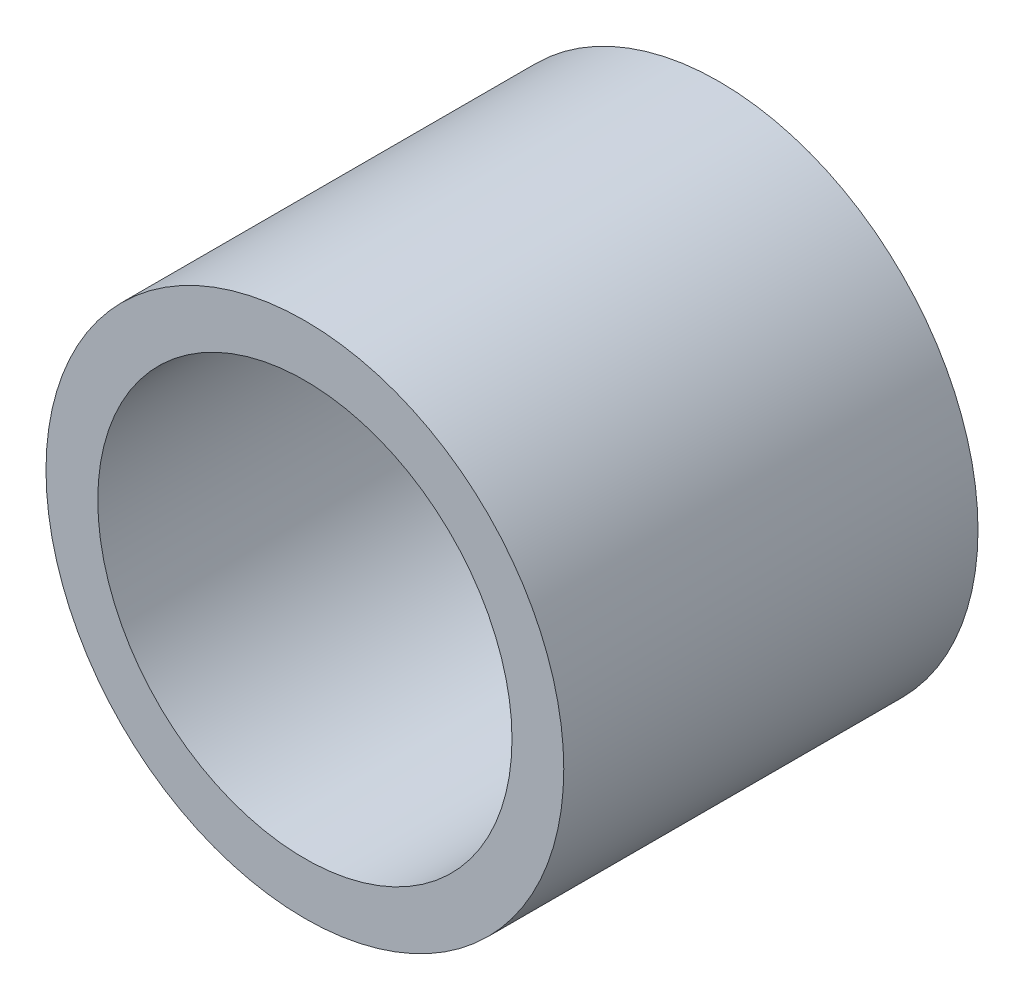
ISO-10303-21;
HEADER;
FILE_DESCRIPTION(('STEP AP214'),'2;1');
FILE_NAME('part.step','',(''),(''),'','','');
FILE_SCHEMA(('AUTOMOTIVE_DESIGN { 1 0 10303 214 1 1 1 1 }'));
ENDSEC;
DATA;
#1=APPLICATION_CONTEXT('core data for automotive mechanical design processes');
#2=APPLICATION_PROTOCOL_DEFINITION('international standard','automotive_design',2000,#1);
#3=PRODUCT_CONTEXT('',#1,'mechanical');
#4=PRODUCT('Part','Part','',(#3));
#5=PRODUCT_RELATED_PRODUCT_CATEGORY('part','',(#4));
#6=PRODUCT_DEFINITION_FORMATION('','',#4);
#7=PRODUCT_DEFINITION_CONTEXT('part definition',#1,'design');
#8=PRODUCT_DEFINITION('design','',#6,#7);
#9=PRODUCT_DEFINITION_SHAPE('','',#8);
#10=(LENGTH_UNIT() NAMED_UNIT(*) SI_UNIT(.MILLI.,.METRE.));
#11=(NAMED_UNIT(*) PLANE_ANGLE_UNIT() SI_UNIT($,.RADIAN.));
#12=(NAMED_UNIT(*) SI_UNIT($,.STERADIAN.) SOLID_ANGLE_UNIT());
#13=UNCERTAINTY_MEASURE_WITH_UNIT(LENGTH_MEASURE(1.E-05),#10,'distance_accuracy_value','');
#14=(GEOMETRIC_REPRESENTATION_CONTEXT(3) GLOBAL_UNCERTAINTY_ASSIGNED_CONTEXT((#13)) GLOBAL_UNIT_ASSIGNED_CONTEXT((#10,
#11,#12)) REPRESENTATION_CONTEXT('',''));
#15=CARTESIAN_POINT('',(0.,0.,0.));
#16=DIRECTION('',(0.,0.,1.));
#17=DIRECTION('',(1.,0.,0.));
#18=AXIS2_PLACEMENT_3D('',#15,#16,#17);
#19=CARTESIAN_POINT('',(0.,0.,6.35));
#20=DIRECTION('',(0.,0.,1.));
#21=DIRECTION('',(1.,0.,0.));
#22=AXIS2_PLACEMENT_3D('',#19,#20,#21);
#23=PLANE('',#22);
#24=CARTESIAN_POINT('',(0.,0.,6.35));
#25=DIRECTION('',(0.,0.,1.));
#26=DIRECTION('',(1.,0.,0.));
#27=AXIS2_PLACEMENT_3D('',#24,#25,#26);
#28=CIRCLE('',#27,7.9375);
#29=CARTESIAN_POINT('',(7.9375,0.,6.35));
#30=VERTEX_POINT('',#29);
#31=EDGE_CURVE('E10',#30,#30,#28,.T.);
#32=ORIENTED_EDGE('',*,*,#31,.T.);
#33=EDGE_LOOP('',(#32));
#34=FACE_BOUND('',#33,.T.);
#35=CARTESIAN_POINT('',(0.,0.,6.35));
#36=DIRECTION('',(0.,0.,1.));
#37=DIRECTION('',(1.,0.,0.));
#38=AXIS2_PLACEMENT_3D('',#35,#36,#37);
#39=CIRCLE('',#38,6.35);
#40=CARTESIAN_POINT('',(6.35,0.,6.35));
#41=VERTEX_POINT('',#40);
#42=EDGE_CURVE('E43',#41,#41,#39,.T.);
#43=ORIENTED_EDGE('',*,*,#42,.F.);
#44=EDGE_LOOP('',(#43));
#45=FACE_BOUND('',#44,.T.);
#46=ADVANCED_FACE('F32',(#34,#45),#23,.T.);
#47=CARTESIAN_POINT('',(0.,0.,-6.35));
#48=DIRECTION('',(0.,0.,1.));
#49=DIRECTION('',(1.,0.,0.));
#50=AXIS2_PLACEMENT_3D('',#47,#48,#49);
#51=PLANE('',#50);
#52=CARTESIAN_POINT('',(0.,0.,-6.35));
#53=DIRECTION('',(0.,0.,1.));
#54=DIRECTION('',(1.,0.,0.));
#55=AXIS2_PLACEMENT_3D('',#52,#53,#54);
#56=CIRCLE('',#55,7.9375);
#57=CARTESIAN_POINT('',(7.9375,0.,-6.35));
#58=VERTEX_POINT('',#57);
#59=EDGE_CURVE('E36',#58,#58,#56,.T.);
#60=ORIENTED_EDGE('',*,*,#59,.F.);
#61=EDGE_LOOP('',(#60));
#62=FACE_BOUND('',#61,.T.);
#63=CARTESIAN_POINT('',(0.,0.,-6.35));
#64=DIRECTION('',(0.,0.,1.));
#65=DIRECTION('',(1.,0.,0.));
#66=AXIS2_PLACEMENT_3D('',#63,#64,#65);
#67=CIRCLE('',#66,6.35);
#68=CARTESIAN_POINT('',(6.35,0.,-6.35));
#69=VERTEX_POINT('',#68);
#70=EDGE_CURVE('E45',#69,#69,#67,.T.);
#71=ORIENTED_EDGE('',*,*,#70,.T.);
#72=EDGE_LOOP('',(#71));
#73=FACE_BOUND('',#72,.T.);
#74=ADVANCED_FACE('F55',(#62,#73),#51,.F.);
#75=CARTESIAN_POINT('',(0.,0.,6.35));
#76=DIRECTION('',(0.,0.,-1.));
#77=DIRECTION('',(-1.,0.,0.));
#78=AXIS2_PLACEMENT_3D('',#75,#76,#77);
#79=CYLINDRICAL_SURFACE('',#78,7.9375);
#80=ORIENTED_EDGE('',*,*,#31,.F.);
#81=EDGE_LOOP('',(#80));
#82=FACE_BOUND('',#81,.T.);
#83=ORIENTED_EDGE('',*,*,#59,.T.);
#84=EDGE_LOOP('',(#83));
#85=FACE_BOUND('',#84,.T.);
#86=ADVANCED_FACE('F34',(#82,#85),#79,.T.);
#87=CARTESIAN_POINT('',(0.,0.,6.35));
#88=DIRECTION('',(0.,0.,-1.));
#89=DIRECTION('',(-1.,0.,0.));
#90=AXIS2_PLACEMENT_3D('',#87,#88,#89);
#91=CYLINDRICAL_SURFACE('',#90,6.35);
#92=ORIENTED_EDGE('',*,*,#42,.T.);
#93=EDGE_LOOP('',(#92));
#94=FACE_BOUND('',#93,.T.);
#95=ORIENTED_EDGE('',*,*,#70,.F.);
#96=EDGE_LOOP('',(#95));
#97=FACE_BOUND('',#96,.T.);
#98=ADVANCED_FACE('F51',(#94,#97),#91,.F.);
#99=CLOSED_SHELL('',(#46,#74,#86,#98));
#100=MANIFOLD_SOLID_BREP('B2',#99);
#101=ADVANCED_BREP_SHAPE_REPRESENTATION('',(#18,#100),#14);
#102=SHAPE_DEFINITION_REPRESENTATION(#9,#101);
ENDSEC;
END-ISO-10303-21;
